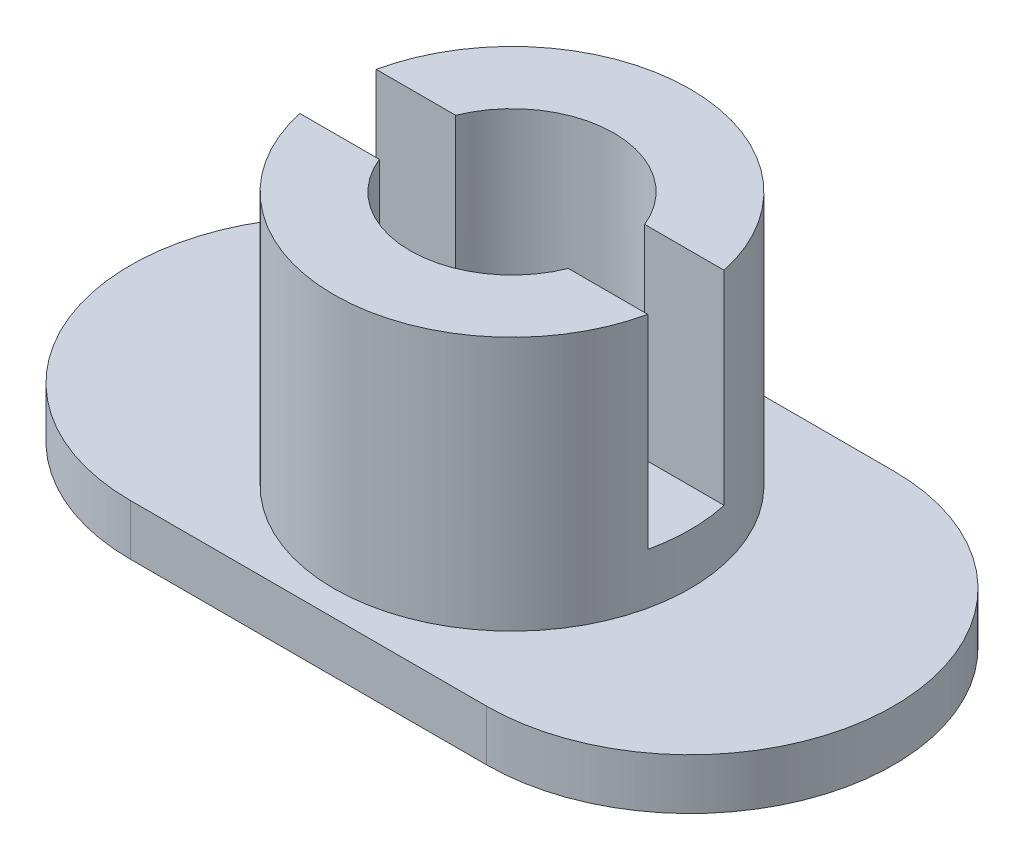
ISO-10303-21;
HEADER;
FILE_DESCRIPTION(('STEP AP214'),'2;1');
FILE_NAME('part.step','',(''),(''),'','','');
FILE_SCHEMA(('AUTOMOTIVE_DESIGN { 1 0 10303 214 1 1 1 1 }'));
ENDSEC;
DATA;
#1=APPLICATION_CONTEXT('core data for automotive mechanical design processes');
#2=APPLICATION_PROTOCOL_DEFINITION('international standard','automotive_design',2000,#1);
#3=PRODUCT_CONTEXT('',#1,'mechanical');
#4=PRODUCT('Part','Part','',(#3));
#5=PRODUCT_RELATED_PRODUCT_CATEGORY('part','',(#4));
#6=PRODUCT_DEFINITION_FORMATION('','',#4);
#7=PRODUCT_DEFINITION_CONTEXT('part definition',#1,'design');
#8=PRODUCT_DEFINITION('design','',#6,#7);
#9=PRODUCT_DEFINITION_SHAPE('','',#8);
#10=(LENGTH_UNIT() NAMED_UNIT(*) SI_UNIT(.MILLI.,.METRE.));
#11=(NAMED_UNIT(*) PLANE_ANGLE_UNIT() SI_UNIT($,.RADIAN.));
#12=(NAMED_UNIT(*) SI_UNIT($,.STERADIAN.) SOLID_ANGLE_UNIT());
#13=UNCERTAINTY_MEASURE_WITH_UNIT(LENGTH_MEASURE(1.E-05),#10,'distance_accuracy_value','');
#14=(GEOMETRIC_REPRESENTATION_CONTEXT(3) GLOBAL_UNCERTAINTY_ASSIGNED_CONTEXT((#13)) GLOBAL_UNIT_ASSIGNED_CONTEXT((#10,
#11,#12)) REPRESENTATION_CONTEXT('',''));
#15=CARTESIAN_POINT('',(0.,0.,0.));
#16=DIRECTION('',(0.,0.,1.));
#17=DIRECTION('',(1.,0.,0.));
#18=AXIS2_PLACEMENT_3D('',#15,#16,#17);
#19=CARTESIAN_POINT('',(0.,6.,0.));
#20=DIRECTION('',(0.,-1.,0.));
#21=DIRECTION('',(0.,0.,-1.));
#22=AXIS2_PLACEMENT_3D('',#19,#20,#21);
#23=CYLINDRICAL_SURFACE('',#22,3.5);
#24=CARTESIAN_POINT('',(0.,1.,0.));
#25=DIRECTION('',(0.,1.,0.));
#26=DIRECTION('',(0.,0.,1.));
#27=AXIS2_PLACEMENT_3D('',#24,#25,#26);
#28=CIRCLE('',#27,3.5);
#29=CARTESIAN_POINT('',(0.,1.,3.5));
#30=VERTEX_POINT('',#29);
#31=EDGE_CURVE('E178',#30,#30,#28,.T.);
#32=ORIENTED_EDGE('',*,*,#31,.T.);
#33=EDGE_LOOP('',(#32));
#34=FACE_BOUND('',#33,.T.);
#35=DIRECTION('',(0.,1.,0.));
#36=VECTOR('',#35,1.);
#37=CARTESIAN_POINT('',(-3.41869858279434,2.,-0.75));
#38=LINE('',#37,#36);
#39=CARTESIAN_POINT('',(-3.41869858279434,2.,-0.75));
#40=VERTEX_POINT('',#39);
#41=CARTESIAN_POINT('',(-3.41869858279434,6.,-0.75));
#42=VERTEX_POINT('',#41);
#43=EDGE_CURVE('E162',#40,#42,#38,.T.);
#44=ORIENTED_EDGE('',*,*,#43,.T.);
#45=CARTESIAN_POINT('',(0.,6.,0.));
#46=DIRECTION('',(0.,1.,0.));
#47=DIRECTION('',(0.,0.,1.));
#48=AXIS2_PLACEMENT_3D('',#45,#46,#47);
#49=CIRCLE('',#48,3.5);
#50=CARTESIAN_POINT('',(3.41869858279434,6.,-0.75));
#51=VERTEX_POINT('',#50);
#52=EDGE_CURVE('E182',#51,#42,#49,.T.);
#53=ORIENTED_EDGE('',*,*,#52,.F.);
#54=DIRECTION('',(0.,1.,0.));
#55=VECTOR('',#54,1.);
#56=CARTESIAN_POINT('',(3.41869858279434,2.,-0.75));
#57=LINE('',#56,#55);
#58=CARTESIAN_POINT('',(3.41869858279434,2.,-0.75));
#59=VERTEX_POINT('',#58);
#60=EDGE_CURVE('E158',#59,#51,#57,.T.);
#61=ORIENTED_EDGE('',*,*,#60,.F.);
#62=CARTESIAN_POINT('',(0.,2.,0.));
#63=DIRECTION('',(0.,1.,0.));
#64=DIRECTION('',(0.,0.,1.));
#65=AXIS2_PLACEMENT_3D('',#62,#63,#64);
#66=CIRCLE('',#65,3.5);
#67=CARTESIAN_POINT('',(3.41869858279434,2.,0.750000000000001));
#68=VERTEX_POINT('',#67);
#69=EDGE_CURVE('E149',#68,#59,#66,.T.);
#70=ORIENTED_EDGE('',*,*,#69,.F.);
#71=DIRECTION('',(0.,1.,0.));
#72=VECTOR('',#71,1.);
#73=CARTESIAN_POINT('',(3.41869858279434,2.,0.750000000000001));
#74=LINE('',#73,#72);
#75=CARTESIAN_POINT('',(3.41869858279434,6.,0.750000000000001));
#76=VERTEX_POINT('',#75);
#77=EDGE_CURVE('E165',#68,#76,#74,.T.);
#78=ORIENTED_EDGE('',*,*,#77,.T.);
#79=CARTESIAN_POINT('',(-3.41869858279434,6.,0.750000000000001));
#80=VERTEX_POINT('',#79);
#81=EDGE_CURVE('E142',#80,#76,#49,.T.);
#82=ORIENTED_EDGE('',*,*,#81,.F.);
#83=DIRECTION('',(0.,1.,0.));
#84=VECTOR('',#83,1.);
#85=CARTESIAN_POINT('',(-3.41869858279434,2.,0.750000000000001));
#86=LINE('',#85,#84);
#87=CARTESIAN_POINT('',(-3.41869858279434,2.,0.750000000000001));
#88=VERTEX_POINT('',#87);
#89=EDGE_CURVE('E124',#88,#80,#86,.T.);
#90=ORIENTED_EDGE('',*,*,#89,.F.);
#91=CARTESIAN_POINT('',(0.,2.,0.));
#92=DIRECTION('',(0.,1.,0.));
#93=DIRECTION('',(0.,0.,1.));
#94=AXIS2_PLACEMENT_3D('',#91,#92,#93);
#95=CIRCLE('',#94,3.5);
#96=EDGE_CURVE('E130',#40,#88,#95,.T.);
#97=ORIENTED_EDGE('',*,*,#96,.F.);
#98=EDGE_LOOP('',(#44,#53,#61,#70,#78,#82,#90,#97));
#99=FACE_BOUND('',#98,.T.);
#100=ADVANCED_FACE('F34',(#34,#99),#23,.T.);
#101=CARTESIAN_POINT('',(0.,6.,0.));
#102=DIRECTION('',(0.,1.,0.));
#103=DIRECTION('',(0.,0.,1.));
#104=AXIS2_PLACEMENT_3D('',#101,#102,#103);
#105=PLANE('',#104);
#106=ORIENTED_EDGE('',*,*,#52,.T.);
#107=DIRECTION('',(1.,0.,0.));
#108=VECTOR('',#107,1.);
#109=CARTESIAN_POINT('',(0.,6.,-0.75));
#110=LINE('',#109,#108);
#111=CARTESIAN_POINT('',(-1.85674614581531,6.,-0.75));
#112=VERTEX_POINT('',#111);
#113=EDGE_CURVE('E138',#42,#112,#110,.T.);
#114=ORIENTED_EDGE('',*,*,#113,.T.);
#115=CARTESIAN_POINT('',(0.,6.,0.));
#116=DIRECTION('',(0.,1.,0.));
#117=DIRECTION('',(0.,0.,1.));
#118=AXIS2_PLACEMENT_3D('',#115,#116,#117);
#119=CIRCLE('',#118,2.0025);
#120=CARTESIAN_POINT('',(1.85674614581531,6.,-0.75));
#121=VERTEX_POINT('',#120);
#122=EDGE_CURVE('E179',#121,#112,#119,.T.);
#123=ORIENTED_EDGE('',*,*,#122,.F.);
#124=DIRECTION('',(1.,0.,0.));
#125=VECTOR('',#124,1.);
#126=CARTESIAN_POINT('',(0.,6.,-0.75));
#127=LINE('',#126,#125);
#128=EDGE_CURVE('E159',#121,#51,#127,.T.);
#129=ORIENTED_EDGE('',*,*,#128,.T.);
#130=EDGE_LOOP('',(#106,#114,#123,#129));
#131=FACE_BOUND('',#130,.T.);
#132=ADVANCED_FACE('F240',(#131),#105,.T.);
#133=CARTESIAN_POINT('',(0.,0.,0.));
#134=DIRECTION('',(0.,1.,0.));
#135=DIRECTION('',(0.,0.,1.));
#136=AXIS2_PLACEMENT_3D('',#133,#134,#135);
#137=CYLINDRICAL_SURFACE('',#136,2.0025);
#138=CARTESIAN_POINT('',(0.,0.,0.));
#139=DIRECTION('',(0.,1.,0.));
#140=DIRECTION('',(0.,0.,1.));
#141=AXIS2_PLACEMENT_3D('',#138,#139,#140);
#142=CIRCLE('',#141,2.0025);
#143=CARTESIAN_POINT('',(0.,0.,2.0025));
#144=VERTEX_POINT('',#143);
#145=EDGE_CURVE('E175',#144,#144,#142,.T.);
#146=ORIENTED_EDGE('',*,*,#145,.F.);
#147=EDGE_LOOP('',(#146));
#148=FACE_BOUND('',#147,.T.);
#149=DIRECTION('',(0.,1.,0.));
#150=VECTOR('',#149,1.);
#151=CARTESIAN_POINT('',(-1.85674614581531,2.,-0.75));
#152=LINE('',#151,#150);
#153=CARTESIAN_POINT('',(-1.85674614581531,2.,-0.75));
#154=VERTEX_POINT('',#153);
#155=EDGE_CURVE('E144',#154,#112,#152,.T.);
#156=ORIENTED_EDGE('',*,*,#155,.F.);
#157=CARTESIAN_POINT('',(0.,2.,0.));
#158=DIRECTION('',(0.,1.,0.));
#159=DIRECTION('',(0.,0.,1.));
#160=AXIS2_PLACEMENT_3D('',#157,#158,#159);
#161=CIRCLE('',#160,2.0025);
#162=CARTESIAN_POINT('',(-1.85674614581531,2.,0.750000000000001));
#163=VERTEX_POINT('',#162);
#164=EDGE_CURVE('E129',#163,#154,#161,.F.);
#165=ORIENTED_EDGE('',*,*,#164,.F.);
#166=DIRECTION('',(0.,1.,0.));
#167=VECTOR('',#166,1.);
#168=CARTESIAN_POINT('',(-1.85674614581531,2.,0.750000000000001));
#169=LINE('',#168,#167);
#170=CARTESIAN_POINT('',(-1.85674614581531,6.,0.750000000000001));
#171=VERTEX_POINT('',#170);
#172=EDGE_CURVE('E127',#163,#171,#169,.T.);
#173=ORIENTED_EDGE('',*,*,#172,.T.);
#174=CARTESIAN_POINT('',(1.85674614581531,6.,0.750000000000001));
#175=VERTEX_POINT('',#174);
#176=EDGE_CURVE('E167',#171,#175,#119,.T.);
#177=ORIENTED_EDGE('',*,*,#176,.T.);
#178=DIRECTION('',(0.,1.,0.));
#179=VECTOR('',#178,1.);
#180=CARTESIAN_POINT('',(1.85674614581531,2.,0.750000000000001));
#181=LINE('',#180,#179);
#182=CARTESIAN_POINT('',(1.85674614581531,2.,0.750000000000001));
#183=VERTEX_POINT('',#182);
#184=EDGE_CURVE('E168',#183,#175,#181,.T.);
#185=ORIENTED_EDGE('',*,*,#184,.F.);
#186=CARTESIAN_POINT('',(0.,2.,0.));
#187=DIRECTION('',(0.,1.,0.));
#188=DIRECTION('',(0.,0.,1.));
#189=AXIS2_PLACEMENT_3D('',#186,#187,#188);
#190=CIRCLE('',#189,2.0025);
#191=CARTESIAN_POINT('',(1.85674614581531,2.,-0.75));
#192=VERTEX_POINT('',#191);
#193=EDGE_CURVE('E153',#192,#183,#190,.F.);
#194=ORIENTED_EDGE('',*,*,#193,.F.);
#195=DIRECTION('',(0.,1.,0.));
#196=VECTOR('',#195,1.);
#197=CARTESIAN_POINT('',(1.85674614581531,2.,-0.75));
#198=LINE('',#197,#196);
#199=EDGE_CURVE('E171',#192,#121,#198,.T.);
#200=ORIENTED_EDGE('',*,*,#199,.T.);
#201=ORIENTED_EDGE('',*,*,#122,.T.);
#202=EDGE_LOOP('',(#156,#165,#173,#177,#185,#194,#200,#201));
#203=FACE_BOUND('',#202,.T.);
#204=ADVANCED_FACE('F238',(#148,#203),#137,.F.);
#205=CARTESIAN_POINT('',(-3.5,1.,0.));
#206=DIRECTION('',(0.,-1.,0.));
#207=DIRECTION('',(0.,0.,-1.));
#208=AXIS2_PLACEMENT_3D('',#205,#206,#207);
#209=CYLINDRICAL_SURFACE('',#208,4.);
#210=CARTESIAN_POINT('',(-3.5,0.,0.));
#211=DIRECTION('',(0.,1.,0.));
#212=DIRECTION('',(0.,0.,1.));
#213=AXIS2_PLACEMENT_3D('',#210,#211,#212);
#214=CIRCLE('',#213,4.);
#215=CARTESIAN_POINT('',(-3.5,0.,-4.));
#216=VERTEX_POINT('',#215);
#217=CARTESIAN_POINT('',(-3.5,0.,4.));
#218=VERTEX_POINT('',#217);
#219=EDGE_CURVE('E185',#216,#218,#214,.T.);
#220=ORIENTED_EDGE('',*,*,#219,.T.);
#221=DIRECTION('',(0.,-1.,0.));
#222=VECTOR('',#221,1.);
#223=CARTESIAN_POINT('',(-3.5,1.,4.));
#224=LINE('',#223,#222);
#225=CARTESIAN_POINT('',(-3.5,1.,4.));
#226=VERTEX_POINT('',#225);
#227=EDGE_CURVE('E11',#226,#218,#224,.T.);
#228=ORIENTED_EDGE('',*,*,#227,.F.);
#229=CARTESIAN_POINT('',(-3.5,1.,0.));
#230=DIRECTION('',(0.,1.,0.));
#231=DIRECTION('',(0.,0.,1.));
#232=AXIS2_PLACEMENT_3D('',#229,#230,#231);
#233=CIRCLE('',#232,4.);
#234=CARTESIAN_POINT('',(-3.5,1.,-4.));
#235=VERTEX_POINT('',#234);
#236=EDGE_CURVE('E188',#235,#226,#233,.T.);
#237=ORIENTED_EDGE('',*,*,#236,.F.);
#238=DIRECTION('',(0.,-1.,0.));
#239=VECTOR('',#238,1.);
#240=CARTESIAN_POINT('',(-3.5,1.,-4.));
#241=LINE('',#240,#239);
#242=EDGE_CURVE('E198',#235,#216,#241,.T.);
#243=ORIENTED_EDGE('',*,*,#242,.T.);
#244=EDGE_LOOP('',(#220,#228,#237,#243));
#245=FACE_BOUND('',#244,.T.);
#246=ADVANCED_FACE('F36',(#245),#209,.T.);
#247=CARTESIAN_POINT('',(-3.5,1.,4.));
#248=DIRECTION('',(0.,0.,-1.));
#249=DIRECTION('',(-1.,0.,0.));
#250=AXIS2_PLACEMENT_3D('',#247,#248,#249);
#251=PLANE('',#250);
#252=DIRECTION('',(1.,0.,0.));
#253=VECTOR('',#252,1.);
#254=CARTESIAN_POINT('',(-3.5,0.,4.));
#255=LINE('',#254,#253);
#256=CARTESIAN_POINT('',(3.5,0.,4.));
#257=VERTEX_POINT('',#256);
#258=EDGE_CURVE('E201',#218,#257,#255,.T.);
#259=ORIENTED_EDGE('',*,*,#258,.T.);
#260=DIRECTION('',(0.,-1.,0.));
#261=VECTOR('',#260,1.);
#262=CARTESIAN_POINT('',(3.5,1.,4.));
#263=LINE('',#262,#261);
#264=CARTESIAN_POINT('',(3.5,1.,4.));
#265=VERTEX_POINT('',#264);
#266=EDGE_CURVE('E42',#265,#257,#263,.T.);
#267=ORIENTED_EDGE('',*,*,#266,.F.);
#268=DIRECTION('',(1.,0.,0.));
#269=VECTOR('',#268,1.);
#270=CARTESIAN_POINT('',(-3.5,1.,4.));
#271=LINE('',#270,#269);
#272=EDGE_CURVE('E191',#226,#265,#271,.T.);
#273=ORIENTED_EDGE('',*,*,#272,.F.);
#274=ORIENTED_EDGE('',*,*,#227,.T.);
#275=EDGE_LOOP('',(#259,#267,#273,#274));
#276=FACE_BOUND('',#275,.T.);
#277=ADVANCED_FACE('F231',(#276),#251,.F.);
#278=CARTESIAN_POINT('',(3.5,1.,0.));
#279=DIRECTION('',(0.,-1.,0.));
#280=DIRECTION('',(0.,0.,-1.));
#281=AXIS2_PLACEMENT_3D('',#278,#279,#280);
#282=CYLINDRICAL_SURFACE('',#281,4.);
#283=CARTESIAN_POINT('',(3.5,0.,0.));
#284=DIRECTION('',(0.,1.,0.));
#285=DIRECTION('',(0.,0.,1.));
#286=AXIS2_PLACEMENT_3D('',#283,#284,#285);
#287=CIRCLE('',#286,4.);
#288=CARTESIAN_POINT('',(3.5,0.,-4.));
#289=VERTEX_POINT('',#288);
#290=EDGE_CURVE('E203',#257,#289,#287,.T.);
#291=ORIENTED_EDGE('',*,*,#290,.T.);
#292=DIRECTION('',(0.,-1.,0.));
#293=VECTOR('',#292,1.);
#294=CARTESIAN_POINT('',(3.5,1.,-4.));
#295=LINE('',#294,#293);
#296=CARTESIAN_POINT('',(3.5,1.,-4.));
#297=VERTEX_POINT('',#296);
#298=EDGE_CURVE('E208',#297,#289,#295,.T.);
#299=ORIENTED_EDGE('',*,*,#298,.F.);
#300=CARTESIAN_POINT('',(3.5,1.,0.));
#301=DIRECTION('',(0.,1.,0.));
#302=DIRECTION('',(0.,0.,1.));
#303=AXIS2_PLACEMENT_3D('',#300,#301,#302);
#304=CIRCLE('',#303,4.);
#305=EDGE_CURVE('E194',#265,#297,#304,.T.);
#306=ORIENTED_EDGE('',*,*,#305,.F.);
#307=ORIENTED_EDGE('',*,*,#266,.T.);
#308=EDGE_LOOP('',(#291,#299,#306,#307));
#309=FACE_BOUND('',#308,.T.);
#310=ADVANCED_FACE('F215',(#309),#282,.T.);
#311=CARTESIAN_POINT('',(-3.5,1.,-4.));
#312=DIRECTION('',(0.,0.,1.));
#313=DIRECTION('',(1.,0.,0.));
#314=AXIS2_PLACEMENT_3D('',#311,#312,#313);
#315=PLANE('',#314);
#316=DIRECTION('',(-1.,0.,0.));
#317=VECTOR('',#316,1.);
#318=CARTESIAN_POINT('',(-3.5,0.,-4.));
#319=LINE('',#318,#317);
#320=EDGE_CURVE('E192',#289,#216,#319,.T.);
#321=ORIENTED_EDGE('',*,*,#320,.T.);
#322=ORIENTED_EDGE('',*,*,#242,.F.);
#323=DIRECTION('',(-1.,0.,0.));
#324=VECTOR('',#323,1.);
#325=CARTESIAN_POINT('',(-3.5,1.,-4.));
#326=LINE('',#325,#324);
#327=EDGE_CURVE('E196',#297,#235,#326,.T.);
#328=ORIENTED_EDGE('',*,*,#327,.F.);
#329=ORIENTED_EDGE('',*,*,#298,.T.);
#330=EDGE_LOOP('',(#321,#322,#328,#329));
#331=FACE_BOUND('',#330,.T.);
#332=ADVANCED_FACE('F224',(#331),#315,.F.);
#333=CARTESIAN_POINT('',(-3.5,1.,0.));
#334=DIRECTION('',(0.,1.,0.));
#335=DIRECTION('',(0.,0.,1.));
#336=AXIS2_PLACEMENT_3D('',#333,#334,#335);
#337=PLANE('',#336);
#338=ORIENTED_EDGE('',*,*,#31,.F.);
#339=EDGE_LOOP('',(#338));
#340=FACE_BOUND('',#339,.T.);
#341=ORIENTED_EDGE('',*,*,#236,.T.);
#342=ORIENTED_EDGE('',*,*,#272,.T.);
#343=ORIENTED_EDGE('',*,*,#305,.T.);
#344=ORIENTED_EDGE('',*,*,#327,.T.);
#345=EDGE_LOOP('',(#341,#342,#343,#344));
#346=FACE_BOUND('',#345,.T.);
#347=ADVANCED_FACE('F230',(#340,#346),#337,.T.);
#348=CARTESIAN_POINT('',(-3.5,0.,0.));
#349=DIRECTION('',(0.,1.,0.));
#350=DIRECTION('',(0.,0.,1.));
#351=AXIS2_PLACEMENT_3D('',#348,#349,#350);
#352=PLANE('',#351);
#353=ORIENTED_EDGE('',*,*,#145,.T.);
#354=EDGE_LOOP('',(#353));
#355=FACE_BOUND('',#354,.T.);
#356=ORIENTED_EDGE('',*,*,#219,.F.);
#357=ORIENTED_EDGE('',*,*,#320,.F.);
#358=ORIENTED_EDGE('',*,*,#290,.F.);
#359=ORIENTED_EDGE('',*,*,#258,.F.);
#360=EDGE_LOOP('',(#356,#357,#358,#359));
#361=FACE_BOUND('',#360,.T.);
#362=ADVANCED_FACE('F221',(#355,#361),#352,.F.);
#363=DIRECTION('',(1.,0.,0.));
#364=VECTOR('',#363,1.);
#365=CARTESIAN_POINT('',(0.,6.,0.750000000000001));
#366=LINE('',#365,#364);
#367=EDGE_CURVE('E387',#80,#171,#366,.T.);
#368=ORIENTED_EDGE('',*,*,#367,.F.);
#369=ORIENTED_EDGE('',*,*,#81,.T.);
#370=DIRECTION('',(1.,0.,0.));
#371=VECTOR('',#370,1.);
#372=CARTESIAN_POINT('',(0.,6.,0.750000000000001));
#373=LINE('',#372,#371);
#374=EDGE_CURVE('E151',#175,#76,#373,.T.);
#375=ORIENTED_EDGE('',*,*,#374,.F.);
#376=ORIENTED_EDGE('',*,*,#176,.F.);
#377=EDGE_LOOP('',(#368,#369,#375,#376));
#378=FACE_BOUND('',#377,.T.);
#379=ADVANCED_FACE('F248',(#378),#105,.T.);
#380=CARTESIAN_POINT('',(0.,2.,0.750000000000001));
#381=DIRECTION('',(0.,0.,1.));
#382=DIRECTION('',(1.,0.,0.));
#383=AXIS2_PLACEMENT_3D('',#380,#381,#382);
#384=PLANE('',#383);
#385=ORIENTED_EDGE('',*,*,#374,.T.);
#386=ORIENTED_EDGE('',*,*,#77,.F.);
#387=DIRECTION('',(1.,0.,0.));
#388=VECTOR('',#387,1.);
#389=CARTESIAN_POINT('',(0.,2.,0.750000000000001));
#390=LINE('',#389,#388);
#391=EDGE_CURVE('E155',#183,#68,#390,.T.);
#392=ORIENTED_EDGE('',*,*,#391,.F.);
#393=ORIENTED_EDGE('',*,*,#184,.T.);
#394=EDGE_LOOP('',(#385,#386,#392,#393));
#395=FACE_BOUND('',#394,.T.);
#396=ADVANCED_FACE('F276',(#395),#384,.F.);
#397=CARTESIAN_POINT('',(0.,2.,-0.75));
#398=DIRECTION('',(0.,0.,1.));
#399=DIRECTION('',(1.,0.,0.));
#400=AXIS2_PLACEMENT_3D('',#397,#398,#399);
#401=PLANE('',#400);
#402=ORIENTED_EDGE('',*,*,#128,.F.);
#403=ORIENTED_EDGE('',*,*,#199,.F.);
#404=DIRECTION('',(1.,0.,0.));
#405=VECTOR('',#404,1.);
#406=CARTESIAN_POINT('',(0.,2.,-0.75));
#407=LINE('',#406,#405);
#408=EDGE_CURVE('E57',#192,#59,#407,.T.);
#409=ORIENTED_EDGE('',*,*,#408,.T.);
#410=ORIENTED_EDGE('',*,*,#60,.T.);
#411=EDGE_LOOP('',(#402,#403,#409,#410));
#412=FACE_BOUND('',#411,.T.);
#413=ADVANCED_FACE('F284',(#412),#401,.T.);
#414=CARTESIAN_POINT('',(0.,2.,0.));
#415=DIRECTION('',(0.,1.,0.));
#416=DIRECTION('',(0.,0.,1.));
#417=AXIS2_PLACEMENT_3D('',#414,#415,#416);
#418=PLANE('',#417);
#419=ORIENTED_EDGE('',*,*,#69,.T.);
#420=ORIENTED_EDGE('',*,*,#408,.F.);
#421=ORIENTED_EDGE('',*,*,#193,.T.);
#422=ORIENTED_EDGE('',*,*,#391,.T.);
#423=EDGE_LOOP('',(#419,#420,#421,#422));
#424=FACE_BOUND('',#423,.T.);
#425=ADVANCED_FACE('F292',(#424),#418,.T.);
#426=CARTESIAN_POINT('',(0.,2.,-0.75));
#427=DIRECTION('',(0.,0.,1.));
#428=DIRECTION('',(1.,0.,0.));
#429=AXIS2_PLACEMENT_3D('',#426,#427,#428);
#430=PLANE('',#429);
#431=ORIENTED_EDGE('',*,*,#113,.F.);
#432=ORIENTED_EDGE('',*,*,#43,.F.);
#433=DIRECTION('',(1.,0.,0.));
#434=VECTOR('',#433,1.);
#435=CARTESIAN_POINT('',(0.,2.,-0.75));
#436=LINE('',#435,#434);
#437=EDGE_CURVE('E135',#40,#154,#436,.T.);
#438=ORIENTED_EDGE('',*,*,#437,.T.);
#439=ORIENTED_EDGE('',*,*,#155,.T.);
#440=EDGE_LOOP('',(#431,#432,#438,#439));
#441=FACE_BOUND('',#440,.T.);
#442=ADVANCED_FACE('F300',(#441),#430,.T.);
#443=CARTESIAN_POINT('',(0.,2.,0.750000000000001));
#444=DIRECTION('',(0.,0.,1.));
#445=DIRECTION('',(1.,0.,0.));
#446=AXIS2_PLACEMENT_3D('',#443,#444,#445);
#447=PLANE('',#446);
#448=ORIENTED_EDGE('',*,*,#367,.T.);
#449=ORIENTED_EDGE('',*,*,#172,.F.);
#450=DIRECTION('',(1.,0.,0.));
#451=VECTOR('',#450,1.);
#452=CARTESIAN_POINT('',(0.,2.,0.750000000000001));
#453=LINE('',#452,#451);
#454=EDGE_CURVE('E49',#88,#163,#453,.T.);
#455=ORIENTED_EDGE('',*,*,#454,.F.);
#456=ORIENTED_EDGE('',*,*,#89,.T.);
#457=EDGE_LOOP('',(#448,#449,#455,#456));
#458=FACE_BOUND('',#457,.T.);
#459=ADVANCED_FACE('F122',(#458),#447,.F.);
#460=CARTESIAN_POINT('',(0.,2.,0.));
#461=DIRECTION('',(0.,1.,0.));
#462=DIRECTION('',(0.,0.,1.));
#463=AXIS2_PLACEMENT_3D('',#460,#461,#462);
#464=PLANE('',#463);
#465=ORIENTED_EDGE('',*,*,#96,.T.);
#466=ORIENTED_EDGE('',*,*,#454,.T.);
#467=ORIENTED_EDGE('',*,*,#164,.T.);
#468=ORIENTED_EDGE('',*,*,#437,.F.);
#469=EDGE_LOOP('',(#465,#466,#467,#468));
#470=FACE_BOUND('',#469,.T.);
#471=ADVANCED_FACE('F134',(#470),#464,.T.);
#472=CLOSED_SHELL('',(#100,#132,#204,#246,#277,#310,#332,#347,#362,#379,#396,#413,#425,#442,
#459,#471));
#473=MANIFOLD_SOLID_BREP('B2',#472);
#474=ADVANCED_BREP_SHAPE_REPRESENTATION('',(#18,#473),#14);
#475=SHAPE_DEFINITION_REPRESENTATION(#9,#474);
ENDSEC;
END-ISO-10303-21;
